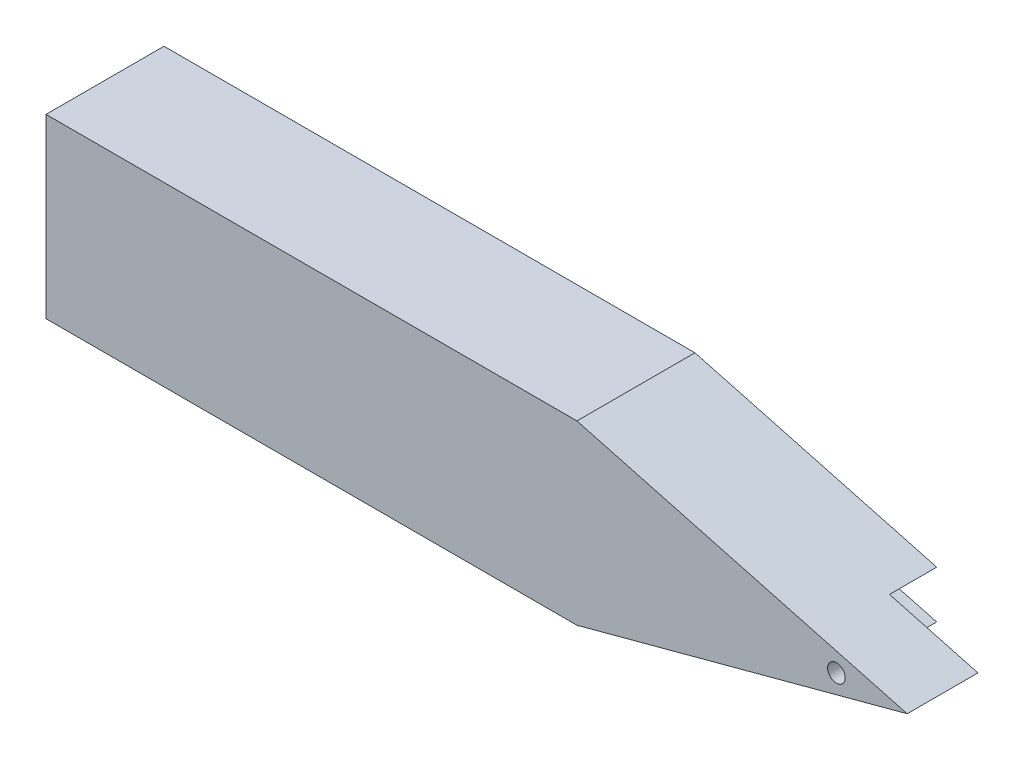
ISO-10303-21;
HEADER;
FILE_DESCRIPTION(('STEP AP214'),'2;1');
FILE_NAME('part.step','',(''),(''),'','','');
FILE_SCHEMA(('AUTOMOTIVE_DESIGN { 1 0 10303 214 1 1 1 1 }'));
ENDSEC;
DATA;
#1=APPLICATION_CONTEXT('core data for automotive mechanical design processes');
#2=APPLICATION_PROTOCOL_DEFINITION('international standard','automotive_design',2000,#1);
#3=PRODUCT_CONTEXT('',#1,'mechanical');
#4=PRODUCT('Part','Part','',(#3));
#5=PRODUCT_RELATED_PRODUCT_CATEGORY('part','',(#4));
#6=PRODUCT_DEFINITION_FORMATION('','',#4);
#7=PRODUCT_DEFINITION_CONTEXT('part definition',#1,'design');
#8=PRODUCT_DEFINITION('design','',#6,#7);
#9=PRODUCT_DEFINITION_SHAPE('','',#8);
#10=(LENGTH_UNIT() NAMED_UNIT(*) SI_UNIT(.MILLI.,.METRE.));
#11=(NAMED_UNIT(*) PLANE_ANGLE_UNIT() SI_UNIT($,.RADIAN.));
#12=(NAMED_UNIT(*) SI_UNIT($,.STERADIAN.) SOLID_ANGLE_UNIT());
#13=UNCERTAINTY_MEASURE_WITH_UNIT(LENGTH_MEASURE(1.E-05),#10,'distance_accuracy_value','');
#14=(GEOMETRIC_REPRESENTATION_CONTEXT(3) GLOBAL_UNCERTAINTY_ASSIGNED_CONTEXT((#13)) GLOBAL_UNIT_ASSIGNED_CONTEXT((#10,
#11,#12)) REPRESENTATION_CONTEXT('',''));
#15=CARTESIAN_POINT('',(0.,0.,0.));
#16=DIRECTION('',(0.,0.,1.));
#17=DIRECTION('',(1.,0.,0.));
#18=AXIS2_PLACEMENT_3D('',#15,#16,#17);
#19=CARTESIAN_POINT('',(-42.5,15.,20.));
#20=DIRECTION('',(0.,-1.,0.));
#21=DIRECTION('',(0.,0.,-1.));
#22=AXIS2_PLACEMENT_3D('',#19,#20,#21);
#23=PLANE('',#22);
#24=DIRECTION('',(-1.,0.,0.));
#25=VECTOR('',#24,1.);
#26=CARTESIAN_POINT('',(-42.5,15.,0.));
#27=LINE('',#26,#25);
#28=CARTESIAN_POINT('',(47.5,15.,0.));
#29=VERTEX_POINT('',#28);
#30=CARTESIAN_POINT('',(-42.5,15.,0.));
#31=VERTEX_POINT('',#30);
#32=EDGE_CURVE('E122',#29,#31,#27,.T.);
#33=ORIENTED_EDGE('',*,*,#32,.T.);
#34=DIRECTION('',(0.,0.,-1.));
#35=VECTOR('',#34,1.);
#36=CARTESIAN_POINT('',(-42.5,15.,20.));
#37=LINE('',#36,#35);
#38=CARTESIAN_POINT('',(-42.5,15.,20.));
#39=VERTEX_POINT('',#38);
#40=EDGE_CURVE('E11',#39,#31,#37,.T.);
#41=ORIENTED_EDGE('',*,*,#40,.F.);
#42=DIRECTION('',(-1.,0.,0.));
#43=VECTOR('',#42,1.);
#44=CARTESIAN_POINT('',(-42.5,15.,20.));
#45=LINE('',#44,#43);
#46=CARTESIAN_POINT('',(47.5,15.,20.));
#47=VERTEX_POINT('',#46);
#48=EDGE_CURVE('E132',#47,#39,#45,.T.);
#49=ORIENTED_EDGE('',*,*,#48,.F.);
#50=DIRECTION('',(0.,0.,-1.));
#51=VECTOR('',#50,1.);
#52=CARTESIAN_POINT('',(47.5,15.,20.));
#53=LINE('',#52,#51);
#54=EDGE_CURVE('E118',#47,#29,#53,.T.);
#55=ORIENTED_EDGE('',*,*,#54,.T.);
#56=EDGE_LOOP('',(#33,#41,#49,#55));
#57=FACE_BOUND('',#56,.T.);
#58=ADVANCED_FACE('F36',(#57),#23,.F.);
#59=CARTESIAN_POINT('',(-42.5,-15.,20.));
#60=DIRECTION('',(1.,0.,0.));
#61=DIRECTION('',(0.,1.,0.));
#62=AXIS2_PLACEMENT_3D('',#59,#60,#61);
#63=PLANE('',#62);
#64=DIRECTION('',(0.,-1.,0.));
#65=VECTOR('',#64,1.);
#66=CARTESIAN_POINT('',(-42.5,-15.,0.));
#67=LINE('',#66,#65);
#68=CARTESIAN_POINT('',(-42.5,-15.,0.));
#69=VERTEX_POINT('',#68);
#70=EDGE_CURVE('E125',#31,#69,#67,.T.);
#71=ORIENTED_EDGE('',*,*,#70,.T.);
#72=DIRECTION('',(0.,0.,-1.));
#73=VECTOR('',#72,1.);
#74=CARTESIAN_POINT('',(-42.5,-15.,20.));
#75=LINE('',#74,#73);
#76=CARTESIAN_POINT('',(-42.5,-15.,20.));
#77=VERTEX_POINT('',#76);
#78=EDGE_CURVE('E43',#77,#69,#75,.T.);
#79=ORIENTED_EDGE('',*,*,#78,.F.);
#80=DIRECTION('',(0.,-1.,0.));
#81=VECTOR('',#80,1.);
#82=CARTESIAN_POINT('',(-42.5,-15.,20.));
#83=LINE('',#82,#81);
#84=EDGE_CURVE('E88',#39,#77,#83,.T.);
#85=ORIENTED_EDGE('',*,*,#84,.F.);
#86=ORIENTED_EDGE('',*,*,#40,.T.);
#87=EDGE_LOOP('',(#71,#79,#85,#86));
#88=FACE_BOUND('',#87,.T.);
#89=ADVANCED_FACE('F158',(#88),#63,.F.);
#90=CARTESIAN_POINT('',(-42.5,-15.,20.));
#91=DIRECTION('',(0.,1.,0.));
#92=DIRECTION('',(0.,0.,1.));
#93=AXIS2_PLACEMENT_3D('',#90,#91,#92);
#94=PLANE('',#93);
#95=DIRECTION('',(1.,0.,0.));
#96=VECTOR('',#95,1.);
#97=CARTESIAN_POINT('',(-42.5,-15.,0.));
#98=LINE('',#97,#96);
#99=CARTESIAN_POINT('',(47.5,-15.,0.));
#100=VERTEX_POINT('',#99);
#101=EDGE_CURVE('E108',#69,#100,#98,.T.);
#102=ORIENTED_EDGE('',*,*,#101,.T.);
#103=DIRECTION('',(0.,0.,-1.));
#104=VECTOR('',#103,1.);
#105=CARTESIAN_POINT('',(47.5,-15.,20.));
#106=LINE('',#105,#104);
#107=CARTESIAN_POINT('',(47.5,-15.,20.));
#108=VERTEX_POINT('',#107);
#109=EDGE_CURVE('E105',#108,#100,#106,.T.);
#110=ORIENTED_EDGE('',*,*,#109,.F.);
#111=DIRECTION('',(1.,0.,0.));
#112=VECTOR('',#111,1.);
#113=CARTESIAN_POINT('',(-42.5,-15.,20.));
#114=LINE('',#113,#112);
#115=EDGE_CURVE('E95',#77,#108,#114,.T.);
#116=ORIENTED_EDGE('',*,*,#115,.F.);
#117=ORIENTED_EDGE('',*,*,#78,.T.);
#118=EDGE_LOOP('',(#102,#110,#116,#117));
#119=FACE_BOUND('',#118,.T.);
#120=ADVANCED_FACE('F106',(#119),#94,.F.);
#121=CARTESIAN_POINT('',(103.480762113534,-2.14025274630179E-13,20.));
#122=DIRECTION('',(-0.258819045102515,0.96592582628907,0.));
#123=DIRECTION('',(-0.96592582628907,-0.258819045102515,0.));
#124=AXIS2_PLACEMENT_3D('',#121,#122,#123);
#125=PLANE('',#124);
#126=DIRECTION('',(0.96592582628907,0.258819045102515,0.));
#127=VECTOR('',#126,1.);
#128=CARTESIAN_POINT('',(103.480762113534,-2.14025274630179E-13,0.));
#129=LINE('',#128,#127);
#130=CARTESIAN_POINT('',(88.4807621135338,-4.01923788646696,0.));
#131=VERTEX_POINT('',#130);
#132=EDGE_CURVE('E129',#100,#131,#129,.T.);
#133=ORIENTED_EDGE('',*,*,#132,.T.);
#134=DIRECTION('',(0.,0.,-1.));
#135=VECTOR('',#134,1.);
#136=CARTESIAN_POINT('',(88.4807621135338,-4.01923788646696,8.));
#137=LINE('',#136,#135);
#138=CARTESIAN_POINT('',(88.4807621135338,-4.01923788646696,8.));
#139=VERTEX_POINT('',#138);
#140=EDGE_CURVE('E50',#139,#131,#137,.T.);
#141=ORIENTED_EDGE('',*,*,#140,.F.);
#142=DIRECTION('',(-0.96592582628907,-0.258819045102515,0.));
#143=VECTOR('',#142,1.);
#144=CARTESIAN_POINT('',(103.480762113534,-2.14021508848639E-13,8.));
#145=LINE('',#144,#143);
#146=CARTESIAN_POINT('',(103.480762113534,-2.14021508848639E-13,8.));
#147=VERTEX_POINT('',#146);
#148=EDGE_CURVE('E142',#147,#139,#145,.T.);
#149=ORIENTED_EDGE('',*,*,#148,.F.);
#150=DIRECTION('',(0.,0.,-1.));
#151=VECTOR('',#150,1.);
#152=CARTESIAN_POINT('',(103.480762113534,-2.14025274630179E-13,20.));
#153=LINE('',#152,#151);
#154=CARTESIAN_POINT('',(103.480762113534,-2.14025274630179E-13,20.));
#155=VERTEX_POINT('',#154);
#156=EDGE_CURVE('E112',#155,#147,#153,.T.);
#157=ORIENTED_EDGE('',*,*,#156,.F.);
#158=DIRECTION('',(0.96592582628907,0.258819045102515,0.));
#159=VECTOR('',#158,1.);
#160=CARTESIAN_POINT('',(103.480762113534,-2.14025274630179E-13,20.));
#161=LINE('',#160,#159);
#162=EDGE_CURVE('E99',#108,#155,#161,.T.);
#163=ORIENTED_EDGE('',*,*,#162,.F.);
#164=ORIENTED_EDGE('',*,*,#109,.T.);
#165=EDGE_LOOP('',(#133,#141,#149,#157,#163,#164));
#166=FACE_BOUND('',#165,.T.);
#167=ADVANCED_FACE('F114',(#166),#125,.F.);
#168=CARTESIAN_POINT('',(47.5,15.,20.));
#169=DIRECTION('',(-0.258819045102521,-0.965925826289068,0.));
#170=DIRECTION('',(0.965925826289068,-0.258819045102521,0.));
#171=AXIS2_PLACEMENT_3D('',#168,#169,#170);
#172=PLANE('',#171);
#173=DIRECTION('',(0.965925826289068,-0.258819045102521,0.));
#174=VECTOR('',#173,1.);
#175=CARTESIAN_POINT('',(88.4807621135338,4.01923788646664,8.));
#176=LINE('',#175,#174);
#177=CARTESIAN_POINT('',(88.4807621135338,4.01923788646664,8.));
#178=VERTEX_POINT('',#177);
#179=EDGE_CURVE('E202',#178,#147,#176,.T.);
#180=ORIENTED_EDGE('',*,*,#179,.F.);
#181=DIRECTION('',(0.,0.,-1.));
#182=VECTOR('',#181,1.);
#183=CARTESIAN_POINT('',(88.4807621135338,4.01923788646664,8.));
#184=LINE('',#183,#182);
#185=CARTESIAN_POINT('',(88.4807621135338,4.01923788646664,0.));
#186=VERTEX_POINT('',#185);
#187=EDGE_CURVE('E126',#178,#186,#184,.T.);
#188=ORIENTED_EDGE('',*,*,#187,.T.);
#189=DIRECTION('',(-0.965925826289068,0.258819045102521,0.));
#190=VECTOR('',#189,1.);
#191=CARTESIAN_POINT('',(47.5,15.,0.));
#192=LINE('',#191,#190);
#193=EDGE_CURVE('E80',#186,#29,#192,.T.);
#194=ORIENTED_EDGE('',*,*,#193,.T.);
#195=ORIENTED_EDGE('',*,*,#54,.F.);
#196=DIRECTION('',(-0.965925826289068,0.258819045102521,0.));
#197=VECTOR('',#196,1.);
#198=CARTESIAN_POINT('',(47.5,15.,20.));
#199=LINE('',#198,#197);
#200=EDGE_CURVE('E59',#155,#47,#199,.T.);
#201=ORIENTED_EDGE('',*,*,#200,.F.);
#202=ORIENTED_EDGE('',*,*,#156,.T.);
#203=EDGE_LOOP('',(#180,#188,#194,#195,#201,#202));
#204=FACE_BOUND('',#203,.T.);
#205=ADVANCED_FACE('F168',(#204),#172,.F.);
#206=CARTESIAN_POINT('',(0.,0.,20.));
#207=DIRECTION('',(0.,0.,1.));
#208=DIRECTION('',(1.,0.,0.));
#209=AXIS2_PLACEMENT_3D('',#206,#207,#208);
#210=PLANE('',#209);
#211=CARTESIAN_POINT('',(91.4807621135338,0.,20.));
#212=DIRECTION('',(0.,0.,-1.));
#213=DIRECTION('',(-1.,0.,0.));
#214=AXIS2_PLACEMENT_3D('',#211,#212,#213);
#215=CIRCLE('',#214,1.5);
#216=CARTESIAN_POINT('',(89.9807621135338,0.,20.));
#217=VERTEX_POINT('',#216);
#218=EDGE_CURVE('E195',#217,#217,#215,.T.);
#219=ORIENTED_EDGE('',*,*,#218,.T.);
#220=EDGE_LOOP('',(#219));
#221=FACE_BOUND('',#220,.T.);
#222=ORIENTED_EDGE('',*,*,#48,.T.);
#223=ORIENTED_EDGE('',*,*,#84,.T.);
#224=ORIENTED_EDGE('',*,*,#115,.T.);
#225=ORIENTED_EDGE('',*,*,#162,.T.);
#226=ORIENTED_EDGE('',*,*,#200,.T.);
#227=EDGE_LOOP('',(#222,#223,#224,#225,#226));
#228=FACE_BOUND('',#227,.T.);
#229=ADVANCED_FACE('F97',(#221,#228),#210,.T.);
#230=CARTESIAN_POINT('',(0.,0.,0.));
#231=DIRECTION('',(0.,0.,1.));
#232=DIRECTION('',(1.,0.,0.));
#233=AXIS2_PLACEMENT_3D('',#230,#231,#232);
#234=PLANE('',#233);
#235=ORIENTED_EDGE('',*,*,#193,.F.);
#236=DIRECTION('',(0.96592582628907,0.258819045102515,0.));
#237=VECTOR('',#236,1.);
#238=CARTESIAN_POINT('',(88.4807621135338,4.01923788646664,0.));
#239=LINE('',#238,#237);
#240=CARTESIAN_POINT('',(73.4807621135338,-1.09531524475348E-13,0.));
#241=VERTEX_POINT('',#240);
#242=EDGE_CURVE('E205',#241,#186,#239,.T.);
#243=ORIENTED_EDGE('',*,*,#242,.F.);
#244=DIRECTION('',(-0.965925826289068,0.258819045102521,0.));
#245=VECTOR('',#244,1.);
#246=CARTESIAN_POINT('',(73.4807621135338,-1.09531524475348E-13,0.));
#247=LINE('',#246,#245);
#248=EDGE_CURVE('E138',#131,#241,#247,.T.);
#249=ORIENTED_EDGE('',*,*,#248,.F.);
#250=ORIENTED_EDGE('',*,*,#132,.F.);
#251=ORIENTED_EDGE('',*,*,#101,.F.);
#252=ORIENTED_EDGE('',*,*,#70,.F.);
#253=ORIENTED_EDGE('',*,*,#32,.F.);
#254=EDGE_LOOP('',(#235,#243,#249,#250,#251,#252,#253));
#255=FACE_BOUND('',#254,.T.);
#256=ADVANCED_FACE('F135',(#255),#234,.F.);
#257=CARTESIAN_POINT('',(88.4807621135338,4.01923788646664,8.));
#258=DIRECTION('',(-0.258819045102515,0.96592582628907,0.));
#259=DIRECTION('',(-0.96592582628907,-0.258819045102515,0.));
#260=AXIS2_PLACEMENT_3D('',#257,#258,#259);
#261=PLANE('',#260);
#262=ORIENTED_EDGE('',*,*,#242,.T.);
#263=ORIENTED_EDGE('',*,*,#187,.F.);
#264=DIRECTION('',(0.96592582628907,0.258819045102515,0.));
#265=VECTOR('',#264,1.);
#266=CARTESIAN_POINT('',(88.4807621135338,4.01923788646664,8.));
#267=LINE('',#266,#265);
#268=CARTESIAN_POINT('',(73.4807621135338,-1.09531524475348E-13,8.));
#269=VERTEX_POINT('',#268);
#270=EDGE_CURVE('E146',#269,#178,#267,.T.);
#271=ORIENTED_EDGE('',*,*,#270,.F.);
#272=DIRECTION('',(0.,0.,-1.));
#273=VECTOR('',#272,1.);
#274=CARTESIAN_POINT('',(73.4807621135338,-1.09531524475348E-13,8.));
#275=LINE('',#274,#273);
#276=EDGE_CURVE('E145',#269,#241,#275,.T.);
#277=ORIENTED_EDGE('',*,*,#276,.T.);
#278=EDGE_LOOP('',(#262,#263,#271,#277));
#279=FACE_BOUND('',#278,.T.);
#280=ADVANCED_FACE('F173',(#279),#261,.F.);
#281=CARTESIAN_POINT('',(73.4807621135338,-1.09531524475348E-13,8.));
#282=DIRECTION('',(-0.258819045102521,-0.965925826289068,0.));
#283=DIRECTION('',(0.965925826289068,-0.258819045102521,0.));
#284=AXIS2_PLACEMENT_3D('',#281,#282,#283);
#285=PLANE('',#284);
#286=ORIENTED_EDGE('',*,*,#248,.T.);
#287=ORIENTED_EDGE('',*,*,#276,.F.);
#288=DIRECTION('',(-0.965925826289068,0.258819045102521,0.));
#289=VECTOR('',#288,1.);
#290=CARTESIAN_POINT('',(73.4807621135338,-1.09531524475348E-13,8.));
#291=LINE('',#290,#289);
#292=EDGE_CURVE('E151',#139,#269,#291,.T.);
#293=ORIENTED_EDGE('',*,*,#292,.F.);
#294=ORIENTED_EDGE('',*,*,#140,.T.);
#295=EDGE_LOOP('',(#286,#287,#293,#294));
#296=FACE_BOUND('',#295,.T.);
#297=ADVANCED_FACE('F177',(#296),#285,.F.);
#298=CARTESIAN_POINT('',(0.,0.,8.));
#299=DIRECTION('',(0.,0.,-1.));
#300=DIRECTION('',(-1.,0.,0.));
#301=AXIS2_PLACEMENT_3D('',#298,#299,#300);
#302=PLANE('',#301);
#303=CARTESIAN_POINT('',(91.4807621135338,0.,8.));
#304=DIRECTION('',(0.,0.,-1.));
#305=DIRECTION('',(-1.,0.,0.));
#306=AXIS2_PLACEMENT_3D('',#303,#304,#305);
#307=CIRCLE('',#306,1.5);
#308=CARTESIAN_POINT('',(89.9807621135338,0.,8.));
#309=VERTEX_POINT('',#308);
#310=EDGE_CURVE('E198',#309,#309,#307,.T.);
#311=ORIENTED_EDGE('',*,*,#310,.F.);
#312=EDGE_LOOP('',(#311));
#313=FACE_BOUND('',#312,.T.);
#314=ORIENTED_EDGE('',*,*,#179,.T.);
#315=ORIENTED_EDGE('',*,*,#148,.T.);
#316=ORIENTED_EDGE('',*,*,#292,.T.);
#317=ORIENTED_EDGE('',*,*,#270,.T.);
#318=EDGE_LOOP('',(#314,#315,#316,#317));
#319=FACE_BOUND('',#318,.T.);
#320=ADVANCED_FACE('F180',(#313,#319),#302,.T.);
#321=CARTESIAN_POINT('',(91.4807621135338,0.,20.));
#322=DIRECTION('',(0.,0.,-1.));
#323=DIRECTION('',(-1.,0.,0.));
#324=AXIS2_PLACEMENT_3D('',#321,#322,#323);
#325=CYLINDRICAL_SURFACE('',#324,1.5);
#326=ORIENTED_EDGE('',*,*,#218,.F.);
#327=EDGE_LOOP('',(#326));
#328=FACE_BOUND('',#327,.T.);
#329=ORIENTED_EDGE('',*,*,#310,.T.);
#330=EDGE_LOOP('',(#329));
#331=FACE_BOUND('',#330,.T.);
#332=ADVANCED_FACE('F186',(#328,#331),#325,.F.);
#333=CLOSED_SHELL('',(#58,#89,#120,#167,#205,#229,#256,#280,#297,#320,#332));
#334=MANIFOLD_SOLID_BREP('B2',#333);
#335=ADVANCED_BREP_SHAPE_REPRESENTATION('',(#18,#334),#14);
#336=SHAPE_DEFINITION_REPRESENTATION(#9,#335);
ENDSEC;
END-ISO-10303-21;
